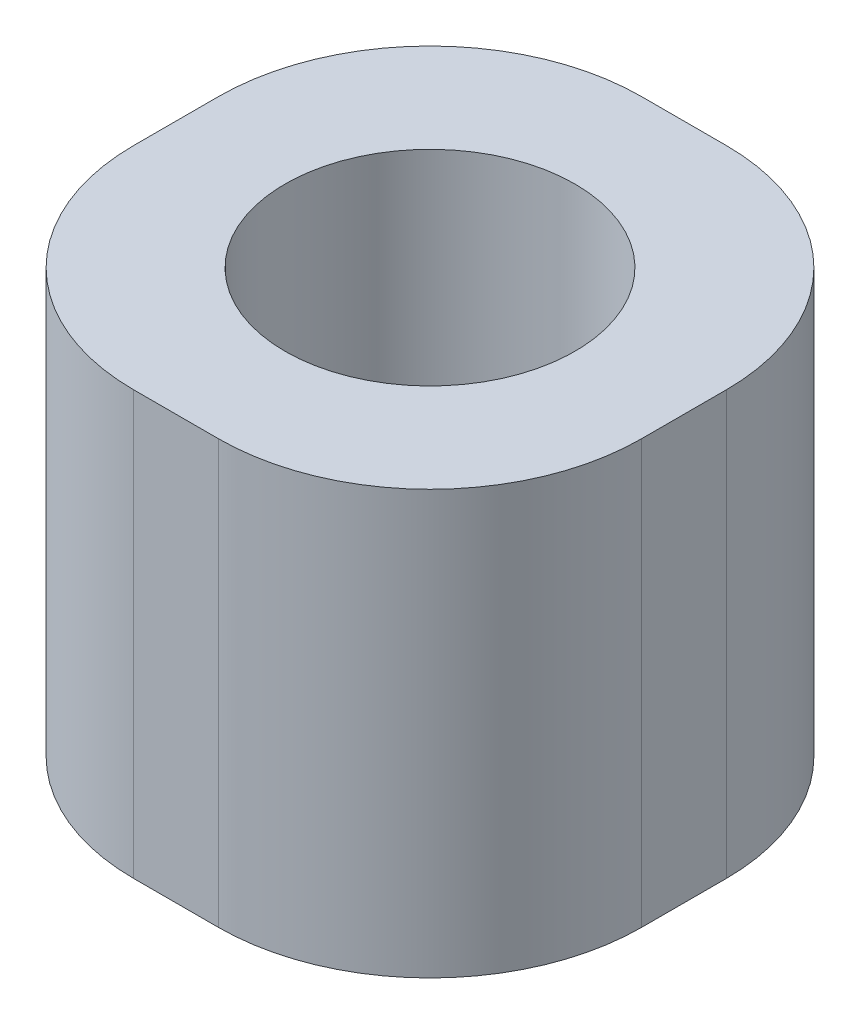
ISO-10303-21;
HEADER;
FILE_DESCRIPTION(('STEP AP214'),'2;1');
FILE_NAME('part.step','',(''),(''),'','','');
FILE_SCHEMA(('AUTOMOTIVE_DESIGN { 1 0 10303 214 1 1 1 1 }'));
ENDSEC;
DATA;
#1=APPLICATION_CONTEXT('core data for automotive mechanical design processes');
#2=APPLICATION_PROTOCOL_DEFINITION('international standard','automotive_design',2000,#1);
#3=PRODUCT_CONTEXT('',#1,'mechanical');
#4=PRODUCT('Part','Part','',(#3));
#5=PRODUCT_RELATED_PRODUCT_CATEGORY('part','',(#4));
#6=PRODUCT_DEFINITION_FORMATION('','',#4);
#7=PRODUCT_DEFINITION_CONTEXT('part definition',#1,'design');
#8=PRODUCT_DEFINITION('design','',#6,#7);
#9=PRODUCT_DEFINITION_SHAPE('','',#8);
#10=(LENGTH_UNIT() NAMED_UNIT(*) SI_UNIT(.MILLI.,.METRE.));
#11=(NAMED_UNIT(*) PLANE_ANGLE_UNIT() SI_UNIT($,.RADIAN.));
#12=(NAMED_UNIT(*) SI_UNIT($,.STERADIAN.) SOLID_ANGLE_UNIT());
#13=UNCERTAINTY_MEASURE_WITH_UNIT(LENGTH_MEASURE(1.E-05),#10,'distance_accuracy_value','');
#14=(GEOMETRIC_REPRESENTATION_CONTEXT(3) GLOBAL_UNCERTAINTY_ASSIGNED_CONTEXT((#13)) GLOBAL_UNIT_ASSIGNED_CONTEXT((#10,
#11,#12)) REPRESENTATION_CONTEXT('',''));
#15=CARTESIAN_POINT('',(0.,0.,0.));
#16=DIRECTION('',(0.,0.,1.));
#17=DIRECTION('',(1.,0.,0.));
#18=AXIS2_PLACEMENT_3D('',#15,#16,#17);
#19=CARTESIAN_POINT('',(0.,0.,0.));
#20=DIRECTION('',(0.,1.,0.));
#21=DIRECTION('',(0.,0.,1.));
#22=AXIS2_PLACEMENT_3D('',#19,#20,#21);
#23=CYLINDRICAL_SURFACE('',#22,2.);
#24=CARTESIAN_POINT('',(0.,0.,0.));
#25=DIRECTION('',(0.,1.,0.));
#26=DIRECTION('',(0.,0.,1.));
#27=AXIS2_PLACEMENT_3D('',#24,#25,#26);
#28=CIRCLE('',#27,2.);
#29=CARTESIAN_POINT('',(0.,0.,2.));
#30=VERTEX_POINT('',#29);
#31=EDGE_CURVE('E129',#30,#30,#28,.T.);
#32=ORIENTED_EDGE('',*,*,#31,.F.);
#33=EDGE_LOOP('',(#32));
#34=FACE_BOUND('',#33,.T.);
#35=CARTESIAN_POINT('',(0.,3.65,0.));
#36=DIRECTION('',(0.,1.,0.));
#37=DIRECTION('',(0.,0.,1.));
#38=AXIS2_PLACEMENT_3D('',#35,#36,#37);
#39=CIRCLE('',#38,2.);
#40=CARTESIAN_POINT('',(0.,3.65,2.));
#41=VERTEX_POINT('',#40);
#42=EDGE_CURVE('E37',#41,#41,#39,.F.);
#43=ORIENTED_EDGE('',*,*,#42,.F.);
#44=EDGE_LOOP('',(#43));
#45=FACE_BOUND('',#44,.T.);
#46=ADVANCED_FACE('F33',(#34,#45),#23,.F.);
#47=CARTESIAN_POINT('',(-6.,10.,6.));
#48=DIRECTION('',(1.,0.,0.));
#49=DIRECTION('',(0.,0.,-1.));
#50=AXIS2_PLACEMENT_3D('',#47,#48,#49);
#51=PLANE('',#50);
#52=DIRECTION('',(0.,0.,1.));
#53=VECTOR('',#52,1.);
#54=CARTESIAN_POINT('',(-6.,10.,6.));
#55=LINE('',#54,#53);
#56=CARTESIAN_POINT('',(-6.,10.,-1.));
#57=VERTEX_POINT('',#56);
#58=CARTESIAN_POINT('',(-6.,10.,0.999999999999999));
#59=VERTEX_POINT('',#58);
#60=EDGE_CURVE('E121',#57,#59,#55,.T.);
#61=ORIENTED_EDGE('',*,*,#60,.F.);
#62=DIRECTION('',(0.,-1.,0.));
#63=VECTOR('',#62,1.);
#64=CARTESIAN_POINT('',(-6.,10.,-1.));
#65=LINE('',#64,#63);
#66=CARTESIAN_POINT('',(-6.,0.,-1.));
#67=VERTEX_POINT('',#66);
#68=EDGE_CURVE('E105',#57,#67,#65,.T.);
#69=ORIENTED_EDGE('',*,*,#68,.T.);
#70=DIRECTION('',(0.,0.,1.));
#71=VECTOR('',#70,1.);
#72=CARTESIAN_POINT('',(-6.,0.,6.));
#73=LINE('',#72,#71);
#74=CARTESIAN_POINT('',(-6.,0.,0.999999999999999));
#75=VERTEX_POINT('',#74);
#76=EDGE_CURVE('E118',#67,#75,#73,.T.);
#77=ORIENTED_EDGE('',*,*,#76,.T.);
#78=DIRECTION('',(0.,-1.,0.));
#79=VECTOR('',#78,1.);
#80=CARTESIAN_POINT('',(-6.,10.,0.999999999999999));
#81=LINE('',#80,#79);
#82=EDGE_CURVE('E123',#75,#59,#81,.F.);
#83=ORIENTED_EDGE('',*,*,#82,.T.);
#84=EDGE_LOOP('',(#61,#69,#77,#83));
#85=FACE_BOUND('',#84,.T.);
#86=ADVANCED_FACE('F117',(#85),#51,.F.);
#87=CARTESIAN_POINT('',(6.,10.,6.));
#88=DIRECTION('',(0.,0.,-1.));
#89=DIRECTION('',(-1.,0.,0.));
#90=AXIS2_PLACEMENT_3D('',#87,#88,#89);
#91=PLANE('',#90);
#92=DIRECTION('',(1.,0.,0.));
#93=VECTOR('',#92,1.);
#94=CARTESIAN_POINT('',(6.,10.,6.));
#95=LINE('',#94,#93);
#96=CARTESIAN_POINT('',(-1.,10.,6.));
#97=VERTEX_POINT('',#96);
#98=CARTESIAN_POINT('',(0.999999999999998,10.,6.));
#99=VERTEX_POINT('',#98);
#100=EDGE_CURVE('E165',#97,#99,#95,.T.);
#101=ORIENTED_EDGE('',*,*,#100,.F.);
#102=DIRECTION('',(0.,-1.,0.));
#103=VECTOR('',#102,1.);
#104=CARTESIAN_POINT('',(-1.,10.,6.));
#105=LINE('',#104,#103);
#106=CARTESIAN_POINT('',(-1.,0.,6.));
#107=VERTEX_POINT('',#106);
#108=EDGE_CURVE('E11',#97,#107,#105,.T.);
#109=ORIENTED_EDGE('',*,*,#108,.T.);
#110=DIRECTION('',(1.,0.,0.));
#111=VECTOR('',#110,1.);
#112=CARTESIAN_POINT('',(6.,0.,6.));
#113=LINE('',#112,#111);
#114=CARTESIAN_POINT('',(0.999999999999998,0.,6.));
#115=VERTEX_POINT('',#114);
#116=EDGE_CURVE('E128',#107,#115,#113,.T.);
#117=ORIENTED_EDGE('',*,*,#116,.T.);
#118=DIRECTION('',(0.,-1.,0.));
#119=VECTOR('',#118,1.);
#120=CARTESIAN_POINT('',(0.999999999999998,10.,6.));
#121=LINE('',#120,#119);
#122=EDGE_CURVE('E42',#115,#99,#121,.F.);
#123=ORIENTED_EDGE('',*,*,#122,.T.);
#124=EDGE_LOOP('',(#101,#109,#117,#123));
#125=FACE_BOUND('',#124,.T.);
#126=ADVANCED_FACE('F164',(#125),#91,.F.);
#127=CARTESIAN_POINT('',(6.,10.,6.));
#128=DIRECTION('',(-1.,0.,0.));
#129=DIRECTION('',(0.,0.,1.));
#130=AXIS2_PLACEMENT_3D('',#127,#128,#129);
#131=PLANE('',#130);
#132=DIRECTION('',(0.,0.,-1.));
#133=VECTOR('',#132,1.);
#134=CARTESIAN_POINT('',(6.,0.,6.));
#135=LINE('',#134,#133);
#136=CARTESIAN_POINT('',(6.,0.,0.999999999999999));
#137=VERTEX_POINT('',#136);
#138=CARTESIAN_POINT('',(6.,0.,-1.));
#139=VERTEX_POINT('',#138);
#140=EDGE_CURVE('E132',#137,#139,#135,.T.);
#141=ORIENTED_EDGE('',*,*,#140,.T.);
#142=DIRECTION('',(0.,-1.,0.));
#143=VECTOR('',#142,1.);
#144=CARTESIAN_POINT('',(6.,10.,-1.));
#145=LINE('',#144,#143);
#146=CARTESIAN_POINT('',(6.,10.,-1.));
#147=VERTEX_POINT('',#146);
#148=EDGE_CURVE('E49',#139,#147,#145,.F.);
#149=ORIENTED_EDGE('',*,*,#148,.T.);
#150=DIRECTION('',(0.,0.,-1.));
#151=VECTOR('',#150,1.);
#152=CARTESIAN_POINT('',(6.,10.,6.));
#153=LINE('',#152,#151);
#154=CARTESIAN_POINT('',(6.,10.,0.999999999999999));
#155=VERTEX_POINT('',#154);
#156=EDGE_CURVE('E171',#155,#147,#153,.T.);
#157=ORIENTED_EDGE('',*,*,#156,.F.);
#158=DIRECTION('',(0.,-1.,0.));
#159=VECTOR('',#158,1.);
#160=CARTESIAN_POINT('',(6.,10.,0.999999999999999));
#161=LINE('',#160,#159);
#162=EDGE_CURVE('E157',#155,#137,#161,.T.);
#163=ORIENTED_EDGE('',*,*,#162,.T.);
#164=EDGE_LOOP('',(#141,#149,#157,#163));
#165=FACE_BOUND('',#164,.T.);
#166=ADVANCED_FACE('F175',(#165),#131,.F.);
#167=CARTESIAN_POINT('',(6.,10.,-6.));
#168=DIRECTION('',(0.,0.,1.));
#169=DIRECTION('',(1.,0.,0.));
#170=AXIS2_PLACEMENT_3D('',#167,#168,#169);
#171=PLANE('',#170);
#172=DIRECTION('',(-1.,0.,0.));
#173=VECTOR('',#172,1.);
#174=CARTESIAN_POINT('',(6.,0.,-6.));
#175=LINE('',#174,#173);
#176=CARTESIAN_POINT('',(0.999999999999997,0.,-6.));
#177=VERTEX_POINT('',#176);
#178=CARTESIAN_POINT('',(-1.,0.,-6.));
#179=VERTEX_POINT('',#178);
#180=EDGE_CURVE('E141',#177,#179,#175,.T.);
#181=ORIENTED_EDGE('',*,*,#180,.T.);
#182=DIRECTION('',(0.,-1.,0.));
#183=VECTOR('',#182,1.);
#184=CARTESIAN_POINT('',(-1.,10.,-6.));
#185=LINE('',#184,#183);
#186=CARTESIAN_POINT('',(-1.,10.,-6.));
#187=VERTEX_POINT('',#186);
#188=EDGE_CURVE('E106',#179,#187,#185,.F.);
#189=ORIENTED_EDGE('',*,*,#188,.T.);
#190=DIRECTION('',(-1.,0.,0.));
#191=VECTOR('',#190,1.);
#192=CARTESIAN_POINT('',(6.,10.,-6.));
#193=LINE('',#192,#191);
#194=CARTESIAN_POINT('',(0.999999999999997,10.,-6.));
#195=VERTEX_POINT('',#194);
#196=EDGE_CURVE('E137',#195,#187,#193,.T.);
#197=ORIENTED_EDGE('',*,*,#196,.F.);
#198=DIRECTION('',(0.,-1.,0.));
#199=VECTOR('',#198,1.);
#200=CARTESIAN_POINT('',(0.999999999999997,10.,-6.));
#201=LINE('',#200,#199);
#202=EDGE_CURVE('E111',#195,#177,#201,.T.);
#203=ORIENTED_EDGE('',*,*,#202,.T.);
#204=EDGE_LOOP('',(#181,#189,#197,#203));
#205=FACE_BOUND('',#204,.T.);
#206=ADVANCED_FACE('F182',(#205),#171,.F.);
#207=CARTESIAN_POINT('',(0.,10.,0.));
#208=DIRECTION('',(0.,1.,0.));
#209=DIRECTION('',(0.,0.,1.));
#210=AXIS2_PLACEMENT_3D('',#207,#208,#209);
#211=PLANE('',#210);
#212=CARTESIAN_POINT('',(0.,10.,0.));
#213=DIRECTION('',(0.,1.,0.));
#214=DIRECTION('',(0.,0.,1.));
#215=AXIS2_PLACEMENT_3D('',#212,#213,#214);
#216=CIRCLE('',#215,3.425);
#217=CARTESIAN_POINT('',(0.,10.,3.425));
#218=VERTEX_POINT('',#217);
#219=EDGE_CURVE('E185',#218,#218,#216,.T.);
#220=ORIENTED_EDGE('',*,*,#219,.F.);
#221=EDGE_LOOP('',(#220));
#222=FACE_BOUND('',#221,.T.);
#223=ORIENTED_EDGE('',*,*,#196,.T.);
#224=CARTESIAN_POINT('',(-1.,10.,-1.));
#225=DIRECTION('',(0.,1.,0.));
#226=DIRECTION('',(0.,0.,1.));
#227=AXIS2_PLACEMENT_3D('',#224,#225,#226);
#228=CIRCLE('',#227,5.);
#229=EDGE_CURVE('E155',#187,#57,#228,.T.);
#230=ORIENTED_EDGE('',*,*,#229,.T.);
#231=ORIENTED_EDGE('',*,*,#60,.T.);
#232=CARTESIAN_POINT('',(-1.,10.,0.999999999999999));
#233=DIRECTION('',(0.,1.,0.));
#234=DIRECTION('',(0.,0.,1.));
#235=AXIS2_PLACEMENT_3D('',#232,#233,#234);
#236=CIRCLE('',#235,5.);
#237=EDGE_CURVE('E151',#59,#97,#236,.T.);
#238=ORIENTED_EDGE('',*,*,#237,.T.);
#239=ORIENTED_EDGE('',*,*,#100,.T.);
#240=CARTESIAN_POINT('',(0.999999999999998,10.,0.999999999999999));
#241=DIRECTION('',(0.,1.,0.));
#242=DIRECTION('',(0.,0.,1.));
#243=AXIS2_PLACEMENT_3D('',#240,#241,#242);
#244=CIRCLE('',#243,5.);
#245=EDGE_CURVE('E56',#99,#155,#244,.T.);
#246=ORIENTED_EDGE('',*,*,#245,.T.);
#247=ORIENTED_EDGE('',*,*,#156,.T.);
#248=CARTESIAN_POINT('',(0.999999999999998,10.,-1.));
#249=DIRECTION('',(0.,1.,0.));
#250=DIRECTION('',(0.,0.,1.));
#251=AXIS2_PLACEMENT_3D('',#248,#249,#250);
#252=CIRCLE('',#251,5.);
#253=EDGE_CURVE('E153',#147,#195,#252,.T.);
#254=ORIENTED_EDGE('',*,*,#253,.T.);
#255=EDGE_LOOP('',(#223,#230,#231,#238,#239,#246,#247,#254));
#256=FACE_BOUND('',#255,.T.);
#257=ADVANCED_FACE('F169',(#222,#256),#211,.T.);
#258=CARTESIAN_POINT('',(0.,0.,0.));
#259=DIRECTION('',(0.,1.,0.));
#260=DIRECTION('',(0.,0.,1.));
#261=AXIS2_PLACEMENT_3D('',#258,#259,#260);
#262=PLANE('',#261);
#263=ORIENTED_EDGE('',*,*,#31,.T.);
#264=EDGE_LOOP('',(#263));
#265=FACE_BOUND('',#264,.T.);
#266=ORIENTED_EDGE('',*,*,#76,.F.);
#267=CARTESIAN_POINT('',(-1.,0.,-1.));
#268=DIRECTION('',(0.,1.,0.));
#269=DIRECTION('',(0.,0.,1.));
#270=AXIS2_PLACEMENT_3D('',#267,#268,#269);
#271=CIRCLE('',#270,5.);
#272=EDGE_CURVE('E101',#67,#179,#271,.F.);
#273=ORIENTED_EDGE('',*,*,#272,.T.);
#274=ORIENTED_EDGE('',*,*,#180,.F.);
#275=CARTESIAN_POINT('',(0.999999999999998,0.,-1.));
#276=DIRECTION('',(0.,1.,0.));
#277=DIRECTION('',(0.,0.,1.));
#278=AXIS2_PLACEMENT_3D('',#275,#276,#277);
#279=CIRCLE('',#278,5.);
#280=EDGE_CURVE('E112',#177,#139,#279,.F.);
#281=ORIENTED_EDGE('',*,*,#280,.T.);
#282=ORIENTED_EDGE('',*,*,#140,.F.);
#283=CARTESIAN_POINT('',(0.999999999999998,0.,0.999999999999999));
#284=DIRECTION('',(0.,1.,0.));
#285=DIRECTION('',(0.,0.,1.));
#286=AXIS2_PLACEMENT_3D('',#283,#284,#285);
#287=CIRCLE('',#286,5.);
#288=EDGE_CURVE('E122',#137,#115,#287,.F.);
#289=ORIENTED_EDGE('',*,*,#288,.T.);
#290=ORIENTED_EDGE('',*,*,#116,.F.);
#291=CARTESIAN_POINT('',(-1.,0.,0.999999999999999));
#292=DIRECTION('',(0.,1.,0.));
#293=DIRECTION('',(0.,0.,1.));
#294=AXIS2_PLACEMENT_3D('',#291,#292,#293);
#295=CIRCLE('',#294,5.);
#296=EDGE_CURVE('E127',#107,#75,#295,.F.);
#297=ORIENTED_EDGE('',*,*,#296,.T.);
#298=EDGE_LOOP('',(#266,#273,#274,#281,#282,#289,#290,#297));
#299=FACE_BOUND('',#298,.T.);
#300=ADVANCED_FACE('F125',(#265,#299),#262,.F.);
#301=CARTESIAN_POINT('',(-1.,10.,-1.));
#302=DIRECTION('',(0.,-1.,0.));
#303=DIRECTION('',(0.,0.,-1.));
#304=AXIS2_PLACEMENT_3D('',#301,#302,#303);
#305=CYLINDRICAL_SURFACE('',#304,5.);
#306=ORIENTED_EDGE('',*,*,#229,.F.);
#307=ORIENTED_EDGE('',*,*,#188,.F.);
#308=ORIENTED_EDGE('',*,*,#272,.F.);
#309=ORIENTED_EDGE('',*,*,#68,.F.);
#310=EDGE_LOOP('',(#306,#307,#308,#309));
#311=FACE_BOUND('',#310,.T.);
#312=ADVANCED_FACE('F104',(#311),#305,.T.);
#313=CARTESIAN_POINT('',(0.999999999999998,10.,-1.));
#314=DIRECTION('',(0.,-1.,0.));
#315=DIRECTION('',(0.,0.,-1.));
#316=AXIS2_PLACEMENT_3D('',#313,#314,#315);
#317=CYLINDRICAL_SURFACE('',#316,5.);
#318=ORIENTED_EDGE('',*,*,#253,.F.);
#319=ORIENTED_EDGE('',*,*,#148,.F.);
#320=ORIENTED_EDGE('',*,*,#280,.F.);
#321=ORIENTED_EDGE('',*,*,#202,.F.);
#322=EDGE_LOOP('',(#318,#319,#320,#321));
#323=FACE_BOUND('',#322,.T.);
#324=ADVANCED_FACE('F179',(#323),#317,.T.);
#325=CARTESIAN_POINT('',(-1.,10.,0.999999999999999));
#326=DIRECTION('',(0.,-1.,0.));
#327=DIRECTION('',(0.,0.,-1.));
#328=AXIS2_PLACEMENT_3D('',#325,#326,#327);
#329=CYLINDRICAL_SURFACE('',#328,5.);
#330=ORIENTED_EDGE('',*,*,#237,.F.);
#331=ORIENTED_EDGE('',*,*,#82,.F.);
#332=ORIENTED_EDGE('',*,*,#296,.F.);
#333=ORIENTED_EDGE('',*,*,#108,.F.);
#334=EDGE_LOOP('',(#330,#331,#332,#333));
#335=FACE_BOUND('',#334,.T.);
#336=ADVANCED_FACE('F224',(#335),#329,.T.);
#337=CARTESIAN_POINT('',(0.999999999999998,10.,0.999999999999999));
#338=DIRECTION('',(0.,-1.,0.));
#339=DIRECTION('',(0.,0.,-1.));
#340=AXIS2_PLACEMENT_3D('',#337,#338,#339);
#341=CYLINDRICAL_SURFACE('',#340,5.);
#342=ORIENTED_EDGE('',*,*,#245,.F.);
#343=ORIENTED_EDGE('',*,*,#122,.F.);
#344=ORIENTED_EDGE('',*,*,#288,.F.);
#345=ORIENTED_EDGE('',*,*,#162,.F.);
#346=EDGE_LOOP('',(#342,#343,#344,#345));
#347=FACE_BOUND('',#346,.T.);
#348=ADVANCED_FACE('F35',(#347),#341,.T.);
#349=CARTESIAN_POINT('',(0.,3.65,0.));
#350=DIRECTION('',(0.,1.,0.));
#351=DIRECTION('',(0.,0.,1.));
#352=AXIS2_PLACEMENT_3D('',#349,#350,#351);
#353=PLANE('',#352);
#354=CARTESIAN_POINT('',(0.,3.65,0.));
#355=DIRECTION('',(0.,1.,0.));
#356=DIRECTION('',(0.,0.,1.));
#357=AXIS2_PLACEMENT_3D('',#354,#355,#356);
#358=CIRCLE('',#357,3.425);
#359=CARTESIAN_POINT('',(0.,3.65,3.425));
#360=VERTEX_POINT('',#359);
#361=EDGE_CURVE('E188',#360,#360,#358,.T.);
#362=ORIENTED_EDGE('',*,*,#361,.T.);
#363=EDGE_LOOP('',(#362));
#364=FACE_BOUND('',#363,.T.);
#365=ORIENTED_EDGE('',*,*,#42,.T.);
#366=EDGE_LOOP('',(#365));
#367=FACE_BOUND('',#366,.T.);
#368=ADVANCED_FACE('F195',(#364,#367),#353,.T.);
#369=CARTESIAN_POINT('',(0.,3.65,0.));
#370=DIRECTION('',(0.,1.,0.));
#371=DIRECTION('',(0.,0.,1.));
#372=AXIS2_PLACEMENT_3D('',#369,#370,#371);
#373=CYLINDRICAL_SURFACE('',#372,3.425);
#374=ORIENTED_EDGE('',*,*,#361,.F.);
#375=EDGE_LOOP('',(#374));
#376=FACE_BOUND('',#375,.T.);
#377=ORIENTED_EDGE('',*,*,#219,.T.);
#378=EDGE_LOOP('',(#377));
#379=FACE_BOUND('',#378,.T.);
#380=ADVANCED_FACE('F207',(#376,#379),#373,.F.);
#381=CLOSED_SHELL('',(#46,#86,#126,#166,#206,#257,#300,#312,#324,#336,#348,#368,#380));
#382=MANIFOLD_SOLID_BREP('B2',#381);
#383=ADVANCED_BREP_SHAPE_REPRESENTATION('',(#18,#382),#14);
#384=SHAPE_DEFINITION_REPRESENTATION(#9,#383);
ENDSEC;
END-ISO-10303-21;
